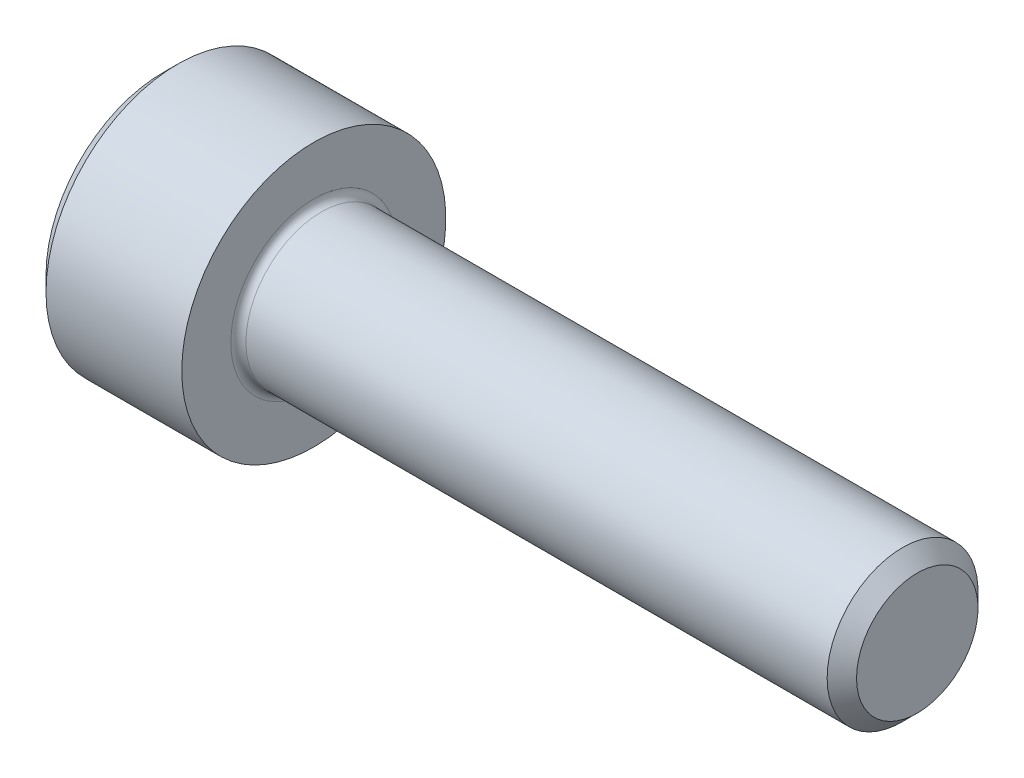
ISO-10303-21;
HEADER;
FILE_DESCRIPTION(('STEP AP214'),'2;1');
FILE_NAME('part.step','',(''),(''),'','','');
FILE_SCHEMA(('AUTOMOTIVE_DESIGN { 1 0 10303 214 1 1 1 1 }'));
ENDSEC;
DATA;
#1=APPLICATION_CONTEXT('core data for automotive mechanical design processes');
#2=APPLICATION_PROTOCOL_DEFINITION('international standard','automotive_design',2000,#1);
#3=PRODUCT_CONTEXT('',#1,'mechanical');
#4=PRODUCT('Part','Part','',(#3));
#5=PRODUCT_RELATED_PRODUCT_CATEGORY('part','',(#4));
#6=PRODUCT_DEFINITION_FORMATION('','',#4);
#7=PRODUCT_DEFINITION_CONTEXT('part definition',#1,'design');
#8=PRODUCT_DEFINITION('design','',#6,#7);
#9=PRODUCT_DEFINITION_SHAPE('','',#8);
#10=(LENGTH_UNIT() NAMED_UNIT(*) SI_UNIT(.MILLI.,.METRE.));
#11=(NAMED_UNIT(*) PLANE_ANGLE_UNIT() SI_UNIT($,.RADIAN.));
#12=(NAMED_UNIT(*) SI_UNIT($,.STERADIAN.) SOLID_ANGLE_UNIT());
#13=UNCERTAINTY_MEASURE_WITH_UNIT(LENGTH_MEASURE(1.E-05),#10,'distance_accuracy_value','');
#14=(GEOMETRIC_REPRESENTATION_CONTEXT(3) GLOBAL_UNCERTAINTY_ASSIGNED_CONTEXT((#13)) GLOBAL_UNIT_ASSIGNED_CONTEXT((#10,
#11,#12)) REPRESENTATION_CONTEXT('',''));
#15=CARTESIAN_POINT('',(0.,0.,0.));
#16=DIRECTION('',(0.,0.,1.));
#17=DIRECTION('',(1.,0.,0.));
#18=AXIS2_PLACEMENT_3D('',#15,#16,#17);
#19=CARTESIAN_POINT('',(0.,0.,0.));
#20=DIRECTION('',(-1.,0.,0.));
#21=DIRECTION('',(0.,0.,1.));
#22=AXIS2_PLACEMENT_3D('',#19,#20,#21);
#23=PLANE('',#22);
#24=DIRECTION('',(0.,-0.5,0.866025403784438));
#25=VECTOR('',#24,1.);
#26=CARTESIAN_POINT('',(0.,1.77304267668134,0.));
#27=LINE('',#26,#25);
#28=CARTESIAN_POINT('',(0.,1.77304267668134,0.));
#29=VERTEX_POINT('',#28);
#30=CARTESIAN_POINT('',(0.,0.886521338340669,1.5355));
#31=VERTEX_POINT('',#30);
#32=EDGE_CURVE('E387',#29,#31,#27,.T.);
#33=ORIENTED_EDGE('',*,*,#32,.T.);
#34=DIRECTION('',(0.,1.,0.));
#35=VECTOR('',#34,1.);
#36=CARTESIAN_POINT('',(0.,-0.886521338340673,1.5355));
#37=LINE('',#36,#35);
#38=CARTESIAN_POINT('',(0.,-0.886521338340673,1.5355));
#39=VERTEX_POINT('',#38);
#40=EDGE_CURVE('E131',#39,#31,#37,.T.);
#41=ORIENTED_EDGE('',*,*,#40,.F.);
#42=DIRECTION('',(0.,-0.500000000000001,-0.866025403784438));
#43=VECTOR('',#42,1.);
#44=CARTESIAN_POINT('',(0.,-0.886521338340673,1.5355));
#45=LINE('',#44,#43);
#46=CARTESIAN_POINT('',(0.,-1.77304267668135,0.));
#47=VERTEX_POINT('',#46);
#48=EDGE_CURVE('E390',#39,#47,#45,.T.);
#49=ORIENTED_EDGE('',*,*,#48,.T.);
#50=DIRECTION('',(0.,0.5,-0.866025403784439));
#51=VECTOR('',#50,1.);
#52=CARTESIAN_POINT('',(0.,-1.77304267668135,0.));
#53=LINE('',#52,#51);
#54=CARTESIAN_POINT('',(0.,-0.886521338340675,-1.5355));
#55=VERTEX_POINT('',#54);
#56=EDGE_CURVE('E393',#47,#55,#53,.T.);
#57=ORIENTED_EDGE('',*,*,#56,.T.);
#58=DIRECTION('',(0.,-1.,0.));
#59=VECTOR('',#58,1.);
#60=CARTESIAN_POINT('',(0.,0.886521338340666,-1.5355));
#61=LINE('',#60,#59);
#62=CARTESIAN_POINT('',(0.,0.886521338340666,-1.5355));
#63=VERTEX_POINT('',#62);
#64=EDGE_CURVE('E396',#63,#55,#61,.T.);
#65=ORIENTED_EDGE('',*,*,#64,.F.);
#66=DIRECTION('',(0.,-0.500000000000001,-0.866025403784438));
#67=VECTOR('',#66,1.);
#68=CARTESIAN_POINT('',(0.,1.77304267668134,0.));
#69=LINE('',#68,#67);
#70=EDGE_CURVE('E126',#29,#63,#69,.T.);
#71=ORIENTED_EDGE('',*,*,#70,.F.);
#72=EDGE_LOOP('',(#33,#41,#49,#57,#65,#71));
#73=FACE_BOUND('',#72,.T.);
#74=CARTESIAN_POINT('',(0.,0.,0.));
#75=DIRECTION('',(-1.,0.,0.));
#76=DIRECTION('',(0.,0.,1.));
#77=AXIS2_PLACEMENT_3D('',#74,#75,#76);
#78=CIRCLE('',#77,3.1);
#79=CARTESIAN_POINT('',(0.,0.,3.1));
#80=VERTEX_POINT('',#79);
#81=EDGE_CURVE('E142',#80,#80,#78,.T.);
#82=ORIENTED_EDGE('',*,*,#81,.T.);
#83=EDGE_LOOP('',(#82));
#84=FACE_BOUND('',#83,.T.);
#85=ADVANCED_FACE('F35',(#73,#84),#23,.T.);
#86=CARTESIAN_POINT('',(20.,1.61,0.));
#87=DIRECTION('',(1.,0.,0.));
#88=DIRECTION('',(0.,0.,-1.));
#89=AXIS2_PLACEMENT_3D('',#86,#87,#88);
#90=PLANE('',#89);
#91=CARTESIAN_POINT('',(20.,0.,0.));
#92=DIRECTION('',(-1.,0.,0.));
#93=DIRECTION('',(0.,0.,1.));
#94=AXIS2_PLACEMENT_3D('',#91,#92,#93);
#95=CIRCLE('',#94,1.61);
#96=CARTESIAN_POINT('',(20.,0.,1.61));
#97=VERTEX_POINT('',#96);
#98=EDGE_CURVE('E155',#97,#97,#95,.T.);
#99=ORIENTED_EDGE('',*,*,#98,.F.);
#100=EDGE_LOOP('',(#99));
#101=FACE_BOUND('',#100,.T.);
#102=ADVANCED_FACE('F176',(#101),#90,.T.);
#103=CARTESIAN_POINT('',(20.,0.,0.));
#104=DIRECTION('',(-1.,0.,0.));
#105=DIRECTION('',(0.,0.,1.));
#106=AXIS2_PLACEMENT_3D('',#103,#104,#105);
#107=CONICAL_SURFACE('',#106,1.61,0.785398163397465);
#108=CARTESIAN_POINT('',(19.61,0.,0.));
#109=DIRECTION('',(-1.,0.,0.));
#110=DIRECTION('',(0.,0.,1.));
#111=AXIS2_PLACEMENT_3D('',#108,#109,#110);
#112=CIRCLE('',#111,2.);
#113=CARTESIAN_POINT('',(19.61,0.,2.));
#114=VERTEX_POINT('',#113);
#115=EDGE_CURVE('E152',#114,#114,#112,.T.);
#116=ORIENTED_EDGE('',*,*,#115,.F.);
#117=EDGE_LOOP('',(#116));
#118=FACE_BOUND('',#117,.T.);
#119=ORIENTED_EDGE('',*,*,#98,.T.);
#120=EDGE_LOOP('',(#119));
#121=FACE_BOUND('',#120,.T.);
#122=ADVANCED_FACE('F182',(#118,#121),#107,.T.);
#123=CARTESIAN_POINT('',(-31.75,0.,0.));
#124=DIRECTION('',(-1.,0.,0.));
#125=DIRECTION('',(0.,0.,1.));
#126=AXIS2_PLACEMENT_3D('',#123,#124,#125);
#127=CYLINDRICAL_SURFACE('',#126,2.);
#128=CARTESIAN_POINT('',(4.2,0.,0.));
#129=DIRECTION('',(1.,0.,0.));
#130=DIRECTION('',(0.,0.,-1.));
#131=AXIS2_PLACEMENT_3D('',#128,#129,#130);
#132=CIRCLE('',#131,2.);
#133=CARTESIAN_POINT('',(4.2,0.,-2.));
#134=VERTEX_POINT('',#133);
#135=EDGE_CURVE('E11',#134,#134,#132,.T.);
#136=ORIENTED_EDGE('',*,*,#135,.T.);
#137=EDGE_LOOP('',(#136));
#138=FACE_BOUND('',#137,.T.);
#139=ORIENTED_EDGE('',*,*,#115,.T.);
#140=EDGE_LOOP('',(#139));
#141=FACE_BOUND('',#140,.T.);
#142=ADVANCED_FACE('F193',(#138,#141),#127,.T.);
#143=CARTESIAN_POINT('',(4.,3.5,0.));
#144=DIRECTION('',(1.,0.,0.));
#145=DIRECTION('',(0.,0.,-1.));
#146=AXIS2_PLACEMENT_3D('',#143,#144,#145);
#147=PLANE('',#146);
#148=CARTESIAN_POINT('',(4.,0.,0.));
#149=DIRECTION('',(1.,0.,0.));
#150=DIRECTION('',(0.,0.,-1.));
#151=AXIS2_PLACEMENT_3D('',#148,#149,#150);
#152=CIRCLE('',#151,2.2);
#153=CARTESIAN_POINT('',(4.,0.,-2.2));
#154=VERTEX_POINT('',#153);
#155=EDGE_CURVE('E43',#154,#154,#152,.F.);
#156=ORIENTED_EDGE('',*,*,#155,.T.);
#157=EDGE_LOOP('',(#156));
#158=FACE_BOUND('',#157,.T.);
#159=CARTESIAN_POINT('',(4.,0.,0.));
#160=DIRECTION('',(-1.,0.,0.));
#161=DIRECTION('',(0.,0.,1.));
#162=AXIS2_PLACEMENT_3D('',#159,#160,#161);
#163=CIRCLE('',#162,3.5);
#164=CARTESIAN_POINT('',(4.,0.,3.5));
#165=VERTEX_POINT('',#164);
#166=EDGE_CURVE('E149',#165,#165,#163,.T.);
#167=ORIENTED_EDGE('',*,*,#166,.F.);
#168=EDGE_LOOP('',(#167));
#169=FACE_BOUND('',#168,.T.);
#170=ADVANCED_FACE('F160',(#158,#169),#147,.T.);
#171=CARTESIAN_POINT('',(-31.75,0.,0.));
#172=DIRECTION('',(-1.,0.,0.));
#173=DIRECTION('',(0.,0.,1.));
#174=AXIS2_PLACEMENT_3D('',#171,#172,#173);
#175=CYLINDRICAL_SURFACE('',#174,3.5);
#176=ORIENTED_EDGE('',*,*,#166,.T.);
#177=EDGE_LOOP('',(#176));
#178=FACE_BOUND('',#177,.T.);
#179=CARTESIAN_POINT('',(0.399999999999998,0.,0.));
#180=DIRECTION('',(-1.,0.,0.));
#181=DIRECTION('',(0.,0.,1.));
#182=AXIS2_PLACEMENT_3D('',#179,#180,#181);
#183=CIRCLE('',#182,3.5);
#184=CARTESIAN_POINT('',(0.399999999999998,0.,3.5));
#185=VERTEX_POINT('',#184);
#186=EDGE_CURVE('E146',#185,#185,#183,.T.);
#187=ORIENTED_EDGE('',*,*,#186,.F.);
#188=EDGE_LOOP('',(#187));
#189=FACE_BOUND('',#188,.T.);
#190=ADVANCED_FACE('F171',(#178,#189),#175,.T.);
#191=CARTESIAN_POINT('',(0.,0.,0.));
#192=DIRECTION('',(1.,0.,0.));
#193=DIRECTION('',(0.,0.,-1.));
#194=AXIS2_PLACEMENT_3D('',#191,#192,#193);
#195=CONICAL_SURFACE('',#194,3.1,0.78539816339745);
#196=ORIENTED_EDGE('',*,*,#186,.T.);
#197=EDGE_LOOP('',(#196));
#198=FACE_BOUND('',#197,.T.);
#199=ORIENTED_EDGE('',*,*,#81,.F.);
#200=EDGE_LOOP('',(#199));
#201=FACE_BOUND('',#200,.T.);
#202=ADVANCED_FACE('F164',(#198,#201),#195,.T.);
#203=CARTESIAN_POINT('',(4.2,0.,0.));
#204=DIRECTION('',(1.,0.,0.));
#205=DIRECTION('',(0.,0.,-1.));
#206=AXIS2_PLACEMENT_3D('',#203,#204,#205);
#207=TOROIDAL_SURFACE('',#206,2.2,0.2);
#208=ORIENTED_EDGE('',*,*,#135,.F.);
#209=EDGE_LOOP('',(#208));
#210=FACE_BOUND('',#209,.T.);
#211=ORIENTED_EDGE('',*,*,#155,.F.);
#212=EDGE_LOOP('',(#211));
#213=FACE_BOUND('',#212,.T.);
#214=ADVANCED_FACE('F37',(#210,#213),#207,.F.);
#215=CARTESIAN_POINT('',(2.,1.77304267668134,0.));
#216=DIRECTION('',(0.,-0.866025403784439,-0.5));
#217=DIRECTION('',(0.,0.5,-0.866025403784438));
#218=AXIS2_PLACEMENT_3D('',#215,#216,#217);
#219=PLANE('',#218);
#220=ORIENTED_EDGE('',*,*,#32,.F.);
#221=DIRECTION('',(-1.,0.,0.));
#222=VECTOR('',#221,1.);
#223=CARTESIAN_POINT('',(2.,1.77304267668134,0.));
#224=LINE('',#223,#222);
#225=CARTESIAN_POINT('',(2.,1.77304267668134,0.));
#226=VERTEX_POINT('',#225);
#227=EDGE_CURVE('E377',#226,#29,#224,.T.);
#228=ORIENTED_EDGE('',*,*,#227,.F.);
#229=DIRECTION('',(0.,-0.5,0.866025403784438));
#230=VECTOR('',#229,1.);
#231=CARTESIAN_POINT('',(2.,1.77304267668134,0.));
#232=LINE('',#231,#230);
#233=CARTESIAN_POINT('',(2.,1.329782007511,0.767749999999999));
#234=VERTEX_POINT('',#233);
#235=EDGE_CURVE('E118',#226,#234,#232,.T.);
#236=ORIENTED_EDGE('',*,*,#235,.T.);
#237=CARTESIAN_POINT('',(2.,0.886521338340669,1.5355));
#238=VERTEX_POINT('',#237);
#239=EDGE_CURVE('E109',#234,#238,#232,.T.);
#240=ORIENTED_EDGE('',*,*,#239,.T.);
#241=DIRECTION('',(-1.,0.,0.));
#242=VECTOR('',#241,1.);
#243=CARTESIAN_POINT('',(2.,0.886521338340669,1.5355));
#244=LINE('',#243,#242);
#245=EDGE_CURVE('E123',#238,#31,#244,.T.);
#246=ORIENTED_EDGE('',*,*,#245,.T.);
#247=EDGE_LOOP('',(#220,#228,#236,#240,#246));
#248=FACE_BOUND('',#247,.T.);
#249=ADVANCED_FACE('F122',(#248),#219,.T.);
#250=CARTESIAN_POINT('',(2.,-0.886521338340673,1.5355));
#251=DIRECTION('',(0.,0.,1.));
#252=DIRECTION('',(0.,-1.,0.));
#253=AXIS2_PLACEMENT_3D('',#250,#251,#252);
#254=PLANE('',#253);
#255=ORIENTED_EDGE('',*,*,#40,.T.);
#256=ORIENTED_EDGE('',*,*,#245,.F.);
#257=DIRECTION('',(0.,1.,0.));
#258=VECTOR('',#257,1.);
#259=CARTESIAN_POINT('',(2.,-0.886521338340673,1.5355));
#260=LINE('',#259,#258);
#261=CARTESIAN_POINT('',(2.,0.,1.5355));
#262=VERTEX_POINT('',#261);
#263=EDGE_CURVE('E106',#262,#238,#260,.T.);
#264=ORIENTED_EDGE('',*,*,#263,.F.);
#265=CARTESIAN_POINT('',(2.,-0.886521338340673,1.5355));
#266=VERTEX_POINT('',#265);
#267=EDGE_CURVE('E117',#266,#262,#260,.T.);
#268=ORIENTED_EDGE('',*,*,#267,.F.);
#269=DIRECTION('',(-1.,0.,0.));
#270=VECTOR('',#269,1.);
#271=CARTESIAN_POINT('',(2.,-0.886521338340673,1.5355));
#272=LINE('',#271,#270);
#273=EDGE_CURVE('E133',#266,#39,#272,.T.);
#274=ORIENTED_EDGE('',*,*,#273,.T.);
#275=EDGE_LOOP('',(#255,#256,#264,#268,#274));
#276=FACE_BOUND('',#275,.T.);
#277=ADVANCED_FACE('F128',(#276),#254,.F.);
#278=CARTESIAN_POINT('',(2.,-0.886521338340673,1.5355));
#279=DIRECTION('',(0.,0.866025403784438,-0.500000000000001));
#280=DIRECTION('',(0.,0.500000000000001,0.866025403784438));
#281=AXIS2_PLACEMENT_3D('',#278,#279,#280);
#282=PLANE('',#281);
#283=ORIENTED_EDGE('',*,*,#48,.F.);
#284=ORIENTED_EDGE('',*,*,#273,.F.);
#285=DIRECTION('',(0.,-0.500000000000001,-0.866025403784438));
#286=VECTOR('',#285,1.);
#287=CARTESIAN_POINT('',(2.,-0.886521338340673,1.5355));
#288=LINE('',#287,#286);
#289=CARTESIAN_POINT('',(2.,-1.32978200751101,0.767750000000003));
#290=VERTEX_POINT('',#289);
#291=EDGE_CURVE('E416',#266,#290,#288,.T.);
#292=ORIENTED_EDGE('',*,*,#291,.T.);
#293=CARTESIAN_POINT('',(2.,-1.77304267668135,0.));
#294=VERTEX_POINT('',#293);
#295=EDGE_CURVE('E405',#290,#294,#288,.T.);
#296=ORIENTED_EDGE('',*,*,#295,.T.);
#297=DIRECTION('',(-1.,0.,0.));
#298=VECTOR('',#297,1.);
#299=CARTESIAN_POINT('',(2.,-1.77304267668135,0.));
#300=LINE('',#299,#298);
#301=EDGE_CURVE('E138',#294,#47,#300,.T.);
#302=ORIENTED_EDGE('',*,*,#301,.T.);
#303=EDGE_LOOP('',(#283,#284,#292,#296,#302));
#304=FACE_BOUND('',#303,.T.);
#305=ADVANCED_FACE('F268',(#304),#282,.T.);
#306=CARTESIAN_POINT('',(2.,-1.77304267668135,0.));
#307=DIRECTION('',(0.,0.866025403784439,0.5));
#308=DIRECTION('',(0.,-0.5,0.866025403784439));
#309=AXIS2_PLACEMENT_3D('',#306,#307,#308);
#310=PLANE('',#309);
#311=ORIENTED_EDGE('',*,*,#56,.F.);
#312=ORIENTED_EDGE('',*,*,#301,.F.);
#313=DIRECTION('',(0.,0.5,-0.866025403784439));
#314=VECTOR('',#313,1.);
#315=CARTESIAN_POINT('',(2.,-1.77304267668135,0.));
#316=LINE('',#315,#314);
#317=CARTESIAN_POINT('',(2.,-1.32978200751101,-0.767750000000002));
#318=VERTEX_POINT('',#317);
#319=EDGE_CURVE('E383',#294,#318,#316,.T.);
#320=ORIENTED_EDGE('',*,*,#319,.T.);
#321=CARTESIAN_POINT('',(2.,-0.886521338340675,-1.5355));
#322=VERTEX_POINT('',#321);
#323=EDGE_CURVE('E415',#318,#322,#316,.T.);
#324=ORIENTED_EDGE('',*,*,#323,.T.);
#325=DIRECTION('',(-1.,0.,0.));
#326=VECTOR('',#325,1.);
#327=CARTESIAN_POINT('',(2.,-0.886521338340675,-1.5355));
#328=LINE('',#327,#326);
#329=EDGE_CURVE('E376',#322,#55,#328,.T.);
#330=ORIENTED_EDGE('',*,*,#329,.T.);
#331=EDGE_LOOP('',(#311,#312,#320,#324,#330));
#332=FACE_BOUND('',#331,.T.);
#333=ADVANCED_FACE('F276',(#332),#310,.T.);
#334=CARTESIAN_POINT('',(2.,0.886521338340666,-1.5355));
#335=DIRECTION('',(0.,0.,-1.));
#336=DIRECTION('',(0.,1.,0.));
#337=AXIS2_PLACEMENT_3D('',#334,#335,#336);
#338=PLANE('',#337);
#339=ORIENTED_EDGE('',*,*,#64,.T.);
#340=ORIENTED_EDGE('',*,*,#329,.F.);
#341=DIRECTION('',(0.,-1.,0.));
#342=VECTOR('',#341,1.);
#343=CARTESIAN_POINT('',(2.,0.886521338340666,-1.5355));
#344=LINE('',#343,#342);
#345=CARTESIAN_POINT('',(2.,0.,-1.5355));
#346=VERTEX_POINT('',#345);
#347=EDGE_CURVE('E380',#346,#322,#344,.T.);
#348=ORIENTED_EDGE('',*,*,#347,.F.);
#349=CARTESIAN_POINT('',(2.,0.886521338340666,-1.5355));
#350=VERTEX_POINT('',#349);
#351=EDGE_CURVE('E50',#350,#346,#344,.T.);
#352=ORIENTED_EDGE('',*,*,#351,.F.);
#353=DIRECTION('',(-1.,0.,0.));
#354=VECTOR('',#353,1.);
#355=CARTESIAN_POINT('',(2.,0.886521338340666,-1.5355));
#356=LINE('',#355,#354);
#357=EDGE_CURVE('E373',#350,#63,#356,.T.);
#358=ORIENTED_EDGE('',*,*,#357,.T.);
#359=EDGE_LOOP('',(#339,#340,#348,#352,#358));
#360=FACE_BOUND('',#359,.T.);
#361=ADVANCED_FACE('F285',(#360),#338,.F.);
#362=CARTESIAN_POINT('',(2.,1.77304267668134,0.));
#363=DIRECTION('',(0.,0.866025403784438,-0.500000000000001));
#364=DIRECTION('',(0.,0.500000000000001,0.866025403784438));
#365=AXIS2_PLACEMENT_3D('',#362,#363,#364);
#366=PLANE('',#365);
#367=ORIENTED_EDGE('',*,*,#70,.T.);
#368=ORIENTED_EDGE('',*,*,#357,.F.);
#369=DIRECTION('',(0.,-0.500000000000001,-0.866025403784438));
#370=VECTOR('',#369,1.);
#371=CARTESIAN_POINT('',(2.,1.77304267668134,0.));
#372=LINE('',#371,#370);
#373=CARTESIAN_POINT('',(2.,1.329782007511,-0.767750000000002));
#374=VERTEX_POINT('',#373);
#375=EDGE_CURVE('E363',#374,#350,#372,.T.);
#376=ORIENTED_EDGE('',*,*,#375,.F.);
#377=EDGE_CURVE('E369',#226,#374,#372,.T.);
#378=ORIENTED_EDGE('',*,*,#377,.F.);
#379=ORIENTED_EDGE('',*,*,#227,.T.);
#380=EDGE_LOOP('',(#367,#368,#376,#378,#379));
#381=FACE_BOUND('',#380,.T.);
#382=ADVANCED_FACE('F294',(#381),#366,.F.);
#383=CARTESIAN_POINT('',(2.,1.77304267668134,0.));
#384=DIRECTION('',(1.,0.,0.));
#385=DIRECTION('',(0.,0.,-1.));
#386=AXIS2_PLACEMENT_3D('',#383,#384,#385);
#387=PLANE('',#386);
#388=ORIENTED_EDGE('',*,*,#347,.T.);
#389=ORIENTED_EDGE('',*,*,#323,.F.);
#390=CARTESIAN_POINT('',(2.,0.,0.));
#391=DIRECTION('',(-1.,0.,0.));
#392=DIRECTION('',(0.,0.,1.));
#393=AXIS2_PLACEMENT_3D('',#390,#391,#392);
#394=CIRCLE('',#393,1.5355);
#395=EDGE_CURVE('E411',#346,#318,#394,.T.);
#396=ORIENTED_EDGE('',*,*,#395,.F.);
#397=EDGE_LOOP('',(#388,#389,#396));
#398=FACE_BOUND('',#397,.T.);
#399=ADVANCED_FACE('F303',(#398),#387,.F.);
#400=ORIENTED_EDGE('',*,*,#319,.F.);
#401=ORIENTED_EDGE('',*,*,#295,.F.);
#402=EDGE_CURVE('E136',#318,#290,#394,.T.);
#403=ORIENTED_EDGE('',*,*,#402,.F.);
#404=EDGE_LOOP('',(#400,#401,#403));
#405=FACE_BOUND('',#404,.T.);
#406=ADVANCED_FACE('F312',(#405),#387,.F.);
#407=ORIENTED_EDGE('',*,*,#291,.F.);
#408=ORIENTED_EDGE('',*,*,#267,.T.);
#409=EDGE_CURVE('E132',#290,#262,#394,.T.);
#410=ORIENTED_EDGE('',*,*,#409,.F.);
#411=EDGE_LOOP('',(#407,#408,#410));
#412=FACE_BOUND('',#411,.T.);
#413=ADVANCED_FACE('F321',(#412),#387,.F.);
#414=ORIENTED_EDGE('',*,*,#263,.T.);
#415=ORIENTED_EDGE('',*,*,#239,.F.);
#416=EDGE_CURVE('E112',#262,#234,#394,.T.);
#417=ORIENTED_EDGE('',*,*,#416,.F.);
#418=EDGE_LOOP('',(#414,#415,#417));
#419=FACE_BOUND('',#418,.T.);
#420=ADVANCED_FACE('F108',(#419),#387,.F.);
#421=ORIENTED_EDGE('',*,*,#235,.F.);
#422=ORIENTED_EDGE('',*,*,#377,.T.);
#423=EDGE_CURVE('E143',#234,#374,#394,.T.);
#424=ORIENTED_EDGE('',*,*,#423,.F.);
#425=EDGE_LOOP('',(#421,#422,#424));
#426=FACE_BOUND('',#425,.T.);
#427=ADVANCED_FACE('F336',(#426),#387,.F.);
#428=ORIENTED_EDGE('',*,*,#375,.T.);
#429=ORIENTED_EDGE('',*,*,#351,.T.);
#430=EDGE_CURVE('E366',#374,#346,#394,.T.);
#431=ORIENTED_EDGE('',*,*,#430,.F.);
#432=EDGE_LOOP('',(#428,#429,#431));
#433=FACE_BOUND('',#432,.T.);
#434=ADVANCED_FACE('F251',(#433),#387,.F.);
#435=CARTESIAN_POINT('',(2.,0.,0.));
#436=DIRECTION('',(-1.,0.,0.));
#437=DIRECTION('',(0.,0.,1.));
#438=AXIS2_PLACEMENT_3D('',#435,#436,#437);
#439=CONICAL_SURFACE('',#438,1.5355,1.04719755119659);
#440=CARTESIAN_POINT('',(2.88652133834068,0.,0.));
#441=VERTEX_POINT('',#440);
#442=VERTEX_LOOP('',#441);
#443=FACE_BOUND('',#442,.T.);
#444=ORIENTED_EDGE('',*,*,#416,.T.);
#445=ORIENTED_EDGE('',*,*,#423,.T.);
#446=ORIENTED_EDGE('',*,*,#430,.T.);
#447=ORIENTED_EDGE('',*,*,#395,.T.);
#448=ORIENTED_EDGE('',*,*,#402,.T.);
#449=ORIENTED_EDGE('',*,*,#409,.T.);
#450=EDGE_LOOP('',(#444,#445,#446,#447,#448,#449));
#451=FACE_BOUND('',#450,.T.);
#452=ADVANCED_FACE('F186',(#443,#451),#439,.F.);
#453=CLOSED_SHELL('',(#85,#102,#122,#142,#170,#190,#202,#214,#249,#277,#305,#333,#361,#382,#399,
#406,#413,#420,#427,#434,#452));
#454=MANIFOLD_SOLID_BREP('B2',#453);
#455=ADVANCED_BREP_SHAPE_REPRESENTATION('',(#18,#454),#14);
#456=SHAPE_DEFINITION_REPRESENTATION(#9,#455);
ENDSEC;
END-ISO-10303-21;
